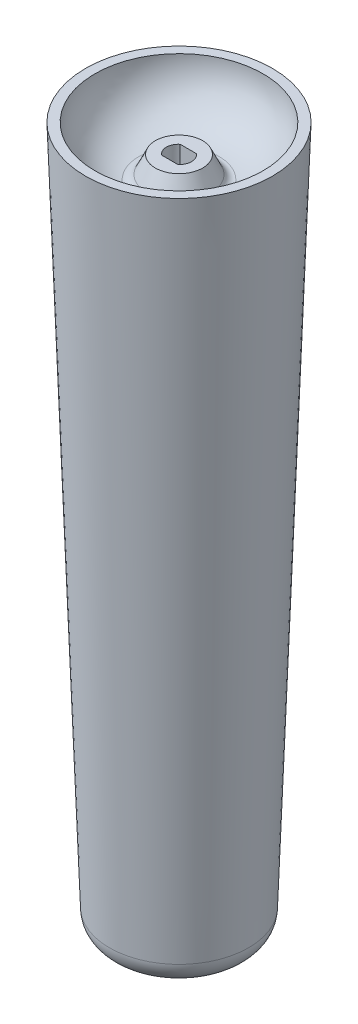
ISO-10303-21;
HEADER;
FILE_DESCRIPTION(('STEP AP214'),'2;1');
FILE_NAME('part.step','',(''),(''),'','','');
FILE_SCHEMA(('AUTOMOTIVE_DESIGN { 1 0 10303 214 1 1 1 1 }'));
ENDSEC;
DATA;
#1=APPLICATION_CONTEXT('core data for automotive mechanical design processes');
#2=APPLICATION_PROTOCOL_DEFINITION('international standard','automotive_design',2000,#1);
#3=PRODUCT_CONTEXT('',#1,'mechanical');
#4=PRODUCT('Part','Part','',(#3));
#5=PRODUCT_RELATED_PRODUCT_CATEGORY('part','',(#4));
#6=PRODUCT_DEFINITION_FORMATION('','',#4);
#7=PRODUCT_DEFINITION_CONTEXT('part definition',#1,'design');
#8=PRODUCT_DEFINITION('design','',#6,#7);
#9=PRODUCT_DEFINITION_SHAPE('','',#8);
#10=(LENGTH_UNIT() NAMED_UNIT(*) SI_UNIT(.MILLI.,.METRE.));
#11=(NAMED_UNIT(*) PLANE_ANGLE_UNIT() SI_UNIT($,.RADIAN.));
#12=(NAMED_UNIT(*) SI_UNIT($,.STERADIAN.) SOLID_ANGLE_UNIT());
#13=UNCERTAINTY_MEASURE_WITH_UNIT(LENGTH_MEASURE(1.E-05),#10,'distance_accuracy_value','');
#14=(GEOMETRIC_REPRESENTATION_CONTEXT(3) GLOBAL_UNCERTAINTY_ASSIGNED_CONTEXT((#13)) GLOBAL_UNIT_ASSIGNED_CONTEXT((#10,
#11,#12)) REPRESENTATION_CONTEXT('',''));
#15=CARTESIAN_POINT('',(0.,0.,0.));
#16=DIRECTION('',(0.,0.,1.));
#17=DIRECTION('',(1.,0.,0.));
#18=AXIS2_PLACEMENT_3D('',#15,#16,#17);
#19=CARTESIAN_POINT('',(0.,-7.18872850840907,0.));
#20=DIRECTION('',(0.,-1.,0.));
#21=DIRECTION('',(0.,0.,-1.));
#22=AXIS2_PLACEMENT_3D('',#19,#20,#21);
#23=CONICAL_SURFACE('',#22,5.35048164496898,0.439460650444469);
#24=CARTESIAN_POINT('',(0.,-6.4087056414976,0.));
#25=DIRECTION('',(0.,-1.,0.));
#26=DIRECTION('',(0.,0.,-1.));
#27=AXIS2_PLACEMENT_3D('',#24,#25,#26);
#28=CIRCLE('',#27,4.9837758856234);
#29=CARTESIAN_POINT('',(0.,-6.4087056414976,-4.9837758856234));
#30=VERTEX_POINT('',#29);
#31=EDGE_CURVE('E140',#30,#30,#28,.F.);
#32=ORIENTED_EDGE('',*,*,#31,.T.);
#33=EDGE_LOOP('',(#32));
#34=FACE_BOUND('',#33,.T.);
#35=CARTESIAN_POINT('',(0.,-3.683,0.));
#36=DIRECTION('',(0.,1.,0.));
#37=DIRECTION('',(0.,0.,1.));
#38=AXIS2_PLACEMENT_3D('',#35,#36,#37);
#39=CIRCLE('',#38,3.70236222530908);
#40=CARTESIAN_POINT('',(0.,-3.683,3.70236222530908));
#41=VERTEX_POINT('',#40);
#42=EDGE_CURVE('E136',#41,#41,#39,.T.);
#43=ORIENTED_EDGE('',*,*,#42,.F.);
#44=EDGE_LOOP('',(#43));
#45=FACE_BOUND('',#44,.T.);
#46=ADVANCED_FACE('F35',(#34,#45),#23,.T.);
#47=CARTESIAN_POINT('',(0.,0.634633404836189,0.));
#48=DIRECTION('',(0.,1.,0.));
#49=DIRECTION('',(0.,0.,1.));
#50=AXIS2_PLACEMENT_3D('',#47,#48,#49);
#51=DEGENERATE_TOROIDAL_SURFACE('',#50,5.32191639984646,7.82341406285296,.T.);
#52=CARTESIAN_POINT('',(0.,-7.12861553218344,0.));
#53=DIRECTION('',(0.,1.,0.));
#54=DIRECTION('',(0.,0.,1.));
#55=AXIS2_PLACEMENT_3D('',#52,#53,#54);
#56=CIRCLE('',#55,6.29030348191064);
#57=CARTESIAN_POINT('',(0.,-7.12861553218344,6.29030348191064));
#58=VERTEX_POINT('',#57);
#59=EDGE_CURVE('E145',#58,#58,#56,.F.);
#60=ORIENTED_EDGE('',*,*,#59,.T.);
#61=EDGE_LOOP('',(#60));
#62=FACE_BOUND('',#61,.T.);
#63=CARTESIAN_POINT('',(0.,0.663198649960341,0.));
#64=DIRECTION('',(0.,1.,0.));
#65=DIRECTION('',(0.,0.,1.));
#66=AXIS2_PLACEMENT_3D('',#63,#64,#65);
#67=CIRCLE('',#66,13.1452783130917);
#68=CARTESIAN_POINT('',(0.,0.663198649960341,13.1452783130917));
#69=VERTEX_POINT('',#68);
#70=EDGE_CURVE('E137',#69,#69,#67,.T.);
#71=ORIENTED_EDGE('',*,*,#70,.T.);
#72=EDGE_LOOP('',(#71));
#73=FACE_BOUND('',#72,.T.);
#74=ADVANCED_FACE('F164',(#62,#73),#51,.F.);
#75=CARTESIAN_POINT('',(13.7077236383959,0.663198649960342,0.));
#76=DIRECTION('',(0.,-1.,0.));
#77=DIRECTION('',(0.,0.,-1.));
#78=AXIS2_PLACEMENT_3D('',#75,#76,#77);
#79=PLANE('',#78);
#80=ORIENTED_EDGE('',*,*,#70,.F.);
#81=EDGE_LOOP('',(#80));
#82=FACE_BOUND('',#81,.T.);
#83=CARTESIAN_POINT('',(0.,0.663198649960339,0.));
#84=DIRECTION('',(0.,-1.,0.));
#85=DIRECTION('',(0.,0.,-1.));
#86=AXIS2_PLACEMENT_3D('',#83,#84,#85);
#87=CIRCLE('',#86,14.605);
#88=CARTESIAN_POINT('',(0.,0.663198649960339,-14.605));
#89=VERTEX_POINT('',#88);
#90=EDGE_CURVE('E133',#89,#89,#87,.T.);
#91=ORIENTED_EDGE('',*,*,#90,.F.);
#92=EDGE_LOOP('',(#91));
#93=FACE_BOUND('',#92,.T.);
#94=ADVANCED_FACE('F170',(#82,#93),#79,.F.);
#95=CARTESIAN_POINT('',(0.,-3.683,0.));
#96=DIRECTION('',(0.,1.,0.));
#97=DIRECTION('',(0.,0.,1.));
#98=AXIS2_PLACEMENT_3D('',#95,#96,#97);
#99=PLANE('',#98);
#100=CARTESIAN_POINT('',(-0.0923636363636069,-3.683,0.));
#101=DIRECTION('',(0.,1.,0.));
#102=DIRECTION('',(0.,0.,1.));
#103=AXIS2_PLACEMENT_3D('',#100,#101,#102);
#104=CIRCLE('',#103,1.87613636363636);
#105=CARTESIAN_POINT('',(-1.26999999999996,-3.683,-1.4605));
#106=VERTEX_POINT('',#105);
#107=CARTESIAN_POINT('',(-1.26999999999996,-3.683,1.46050000000002));
#108=VERTEX_POINT('',#107);
#109=EDGE_CURVE('E54',#106,#108,#104,.T.);
#110=ORIENTED_EDGE('',*,*,#109,.F.);
#111=DIRECTION('',(-1.,0.,0.));
#112=VECTOR('',#111,1.);
#113=CARTESIAN_POINT('',(-1.26999999999996,-3.683,-1.4605));
#114=LINE('',#113,#112);
#115=CARTESIAN_POINT('',(1.27000000000004,-3.683,-1.4605));
#116=VERTEX_POINT('',#115);
#117=EDGE_CURVE('E127',#116,#106,#114,.T.);
#118=ORIENTED_EDGE('',*,*,#117,.F.);
#119=CARTESIAN_POINT('',(0.0923636363636785,-3.683,0.));
#120=DIRECTION('',(0.,1.,0.));
#121=DIRECTION('',(0.,0.,1.));
#122=AXIS2_PLACEMENT_3D('',#119,#120,#121);
#123=CIRCLE('',#122,1.87613636363636);
#124=CARTESIAN_POINT('',(1.27000000000003,-3.683,1.4605));
#125=VERTEX_POINT('',#124);
#126=EDGE_CURVE('E78',#125,#116,#123,.T.);
#127=ORIENTED_EDGE('',*,*,#126,.F.);
#128=DIRECTION('',(1.,0.,0.));
#129=VECTOR('',#128,1.);
#130=CARTESIAN_POINT('',(1.27000000000003,-3.683,1.4605));
#131=LINE('',#130,#129);
#132=EDGE_CURVE('E129',#108,#125,#131,.T.);
#133=ORIENTED_EDGE('',*,*,#132,.F.);
#134=EDGE_LOOP('',(#110,#118,#127,#133));
#135=FACE_BOUND('',#134,.T.);
#136=ORIENTED_EDGE('',*,*,#42,.T.);
#137=EDGE_LOOP('',(#136));
#138=FACE_BOUND('',#137,.T.);
#139=ADVANCED_FACE('F178',(#135,#138),#99,.T.);
#140=CARTESIAN_POINT('',(0.,-5.86838233082078,0.));
#141=DIRECTION('',(0.,1.,0.));
#142=DIRECTION('',(0.,0.,1.));
#143=AXIS2_PLACEMENT_3D('',#140,#141,#142);
#144=TOROIDAL_SURFACE('',#143,6.13310208820439,1.27);
#145=ORIENTED_EDGE('',*,*,#59,.F.);
#146=EDGE_LOOP('',(#145));
#147=FACE_BOUND('',#146,.T.);
#148=ORIENTED_EDGE('',*,*,#31,.F.);
#149=EDGE_LOOP('',(#148));
#150=FACE_BOUND('',#149,.T.);
#151=ADVANCED_FACE('F176',(#147,#150),#144,.F.);
#152=CARTESIAN_POINT('',(0.,-109.347,0.));
#153=DIRECTION('',(0.,-1.,0.));
#154=DIRECTION('',(0.,0.,-1.));
#155=AXIS2_PLACEMENT_3D('',#152,#153,#154);
#156=PLANE('',#155);
#157=CARTESIAN_POINT('',(0.,-109.347,0.));
#158=DIRECTION('',(0.,-1.,0.));
#159=DIRECTION('',(0.,0.,-1.));
#160=AXIS2_PLACEMENT_3D('',#157,#158,#159);
#161=CIRCLE('',#160,7.0840849791884);
#162=CARTESIAN_POINT('',(0.,-109.347,-7.0840849791884));
#163=VERTEX_POINT('',#162);
#164=EDGE_CURVE('E46',#163,#163,#161,.T.);
#165=ORIENTED_EDGE('',*,*,#164,.T.);
#166=EDGE_LOOP('',(#165));
#167=FACE_BOUND('',#166,.T.);
#168=ADVANCED_FACE('F150',(#167),#156,.T.);
#169=CARTESIAN_POINT('',(0.,0.663198649960339,0.));
#170=DIRECTION('',(0.,1.,0.));
#171=DIRECTION('',(0.,0.,-1.));
#172=AXIS2_PLACEMENT_3D('',#169,#170,#171);
#173=CONICAL_SURFACE('',#172,14.605,0.0349065850398867);
#174=CARTESIAN_POINT('',(0.,-105.669967082437,0.));
#175=DIRECTION('',(0.,1.,0.));
#176=DIRECTION('',(0.,0.,1.));
#177=AXIS2_PLACEMENT_3D('',#174,#175,#176);
#178=CIRCLE('',#177,10.8917640301312);
#179=CARTESIAN_POINT('',(0.,-105.669967082437,10.8917640301312));
#180=VERTEX_POINT('',#179);
#181=EDGE_CURVE('E11',#180,#180,#178,.T.);
#182=ORIENTED_EDGE('',*,*,#181,.T.);
#183=EDGE_LOOP('',(#182));
#184=FACE_BOUND('',#183,.T.);
#185=ORIENTED_EDGE('',*,*,#90,.T.);
#186=EDGE_LOOP('',(#185));
#187=FACE_BOUND('',#186,.T.);
#188=ADVANCED_FACE('F154',(#184,#187),#173,.T.);
#189=CARTESIAN_POINT('',(0.,-105.537,0.));
#190=DIRECTION('',(0.,-1.,0.));
#191=DIRECTION('',(0.,0.,-1.));
#192=AXIS2_PLACEMENT_3D('',#189,#190,#191);
#193=TOROIDAL_SURFACE('',#192,7.0840849791884,3.81);
#194=ORIENTED_EDGE('',*,*,#181,.F.);
#195=EDGE_LOOP('',(#194));
#196=FACE_BOUND('',#195,.T.);
#197=ORIENTED_EDGE('',*,*,#164,.F.);
#198=EDGE_LOOP('',(#197));
#199=FACE_BOUND('',#198,.T.);
#200=ADVANCED_FACE('F152',(#196,#199),#193,.T.);
#201=CARTESIAN_POINT('',(-0.0923636363636069,-3.683,0.));
#202=DIRECTION('',(0.,1.,0.));
#203=DIRECTION('',(0.,0.,1.));
#204=AXIS2_PLACEMENT_3D('',#201,#202,#203);
#205=CONICAL_SURFACE('',#204,1.87613636363636,0.0174532925199433);
#206=ORIENTED_EDGE('',*,*,#109,.T.);
#207=CARTESIAN_POINT('',(-1.22371121268793,-11.049,1.33192599173876));
#208=CARTESIAN_POINT('',(-1.23105005130323,-9.9041403436247,1.35190959137449));
#209=CARTESIAN_POINT('',(-1.23832155805528,-8.7592802639708,1.37189319839858));
#210=CARTESIAN_POINT('',(-1.25377204285435,-6.30394706195537,1.41475119886016));
#211=CARTESIAN_POINT('',(-1.26193013187297,-4.99347380827593,1.43762559458983));
#212=CARTESIAN_POINT('',(-1.26999999999995,-3.683,1.46050000000002));
#213=B_SPLINE_CURVE_WITH_KNOTS('',3,(#207,#208,#209,#210,#211,#212),.UNSPECIFIED.,.F.,.F.,(4,2,
4),(0.,3.43517268737795,7.36726748138411),.UNSPECIFIED.);
#214=CARTESIAN_POINT('',(-1.22371121268793,-11.049,1.33192599173876));
#215=VERTEX_POINT('',#214);
#216=EDGE_CURVE('E94',#215,#108,#213,.T.);
#217=ORIENTED_EDGE('',*,*,#216,.F.);
#218=CARTESIAN_POINT('',(-0.0923636363636069,-11.049,0.));
#219=DIRECTION('',(0.,1.,0.));
#220=DIRECTION('',(0.,0.,1.));
#221=AXIS2_PLACEMENT_3D('',#218,#219,#220);
#222=CIRCLE('',#221,1.74756235537511);
#223=CARTESIAN_POINT('',(-1.22371121268794,-11.049,-1.33192599173874));
#224=VERTEX_POINT('',#223);
#225=EDGE_CURVE('E125',#224,#215,#222,.T.);
#226=ORIENTED_EDGE('',*,*,#225,.F.);
#227=CARTESIAN_POINT('',(-1.22371121268794,-11.049,-1.33192599173874));
#228=CARTESIAN_POINT('',(-1.23105005130324,-9.9041403436247,-1.35190959137447));
#229=CARTESIAN_POINT('',(-1.2383215580553,-8.7592802639708,-1.37189319839856));
#230=CARTESIAN_POINT('',(-1.25377204285436,-6.30394706195537,-1.41475119886014));
#231=CARTESIAN_POINT('',(-1.26193013187298,-4.99347380827593,-1.43762559458981));
#232=CARTESIAN_POINT('',(-1.26999999999997,-3.683,-1.4605));
#233=B_SPLINE_CURVE_WITH_KNOTS('',3,(#227,#228,#229,#230,#231,#232),.UNSPECIFIED.,.F.,.F.,(4,2,
4),(0.,3.43517268737795,7.36726748138411),.UNSPECIFIED.);
#234=EDGE_CURVE('E83',#224,#106,#233,.T.);
#235=ORIENTED_EDGE('',*,*,#234,.T.);
#236=EDGE_LOOP('',(#206,#217,#226,#235));
#237=FACE_BOUND('',#236,.T.);
#238=ADVANCED_FACE('F110',(#237),#205,.F.);
#239=CARTESIAN_POINT('',(-1.26999999999996,-3.683,-1.4605));
#240=DIRECTION('',(0.,0.0174524064372835,0.999847695156391));
#241=DIRECTION('',(0.,-0.999847695156391,0.0174524064372835));
#242=AXIS2_PLACEMENT_3D('',#239,#240,#241);
#243=PLANE('',#242);
#244=ORIENTED_EDGE('',*,*,#117,.T.);
#245=ORIENTED_EDGE('',*,*,#234,.F.);
#246=DIRECTION('',(1.,0.,0.));
#247=VECTOR('',#246,1.);
#248=CARTESIAN_POINT('',(-0.0923636363636069,-11.049,-1.33192599173874));
#249=LINE('',#248,#247);
#250=CARTESIAN_POINT('',(1.22371121268802,-11.049,-1.33192599173874));
#251=VERTEX_POINT('',#250);
#252=EDGE_CURVE('E40',#251,#224,#249,.F.);
#253=ORIENTED_EDGE('',*,*,#252,.F.);
#254=CARTESIAN_POINT('',(1.22371121268802,-11.049,-1.33192599173874));
#255=CARTESIAN_POINT('',(1.23105005130332,-9.9041403436247,-1.35190959137447));
#256=CARTESIAN_POINT('',(1.23832155805537,-8.75928026397081,-1.37189319839856));
#257=CARTESIAN_POINT('',(1.25377204285443,-6.30394706195537,-1.41475119886014));
#258=CARTESIAN_POINT('',(1.26193013187306,-4.99347380827593,-1.43762559458981));
#259=CARTESIAN_POINT('',(1.27000000000004,-3.683,-1.4605));
#260=B_SPLINE_CURVE_WITH_KNOTS('',3,(#254,#255,#256,#257,#258,#259),.UNSPECIFIED.,.F.,.F.,(4,2,
4),(0.,3.43517268737794,7.36726748138411),.UNSPECIFIED.);
#261=EDGE_CURVE('E71',#251,#116,#260,.T.);
#262=ORIENTED_EDGE('',*,*,#261,.T.);
#263=EDGE_LOOP('',(#244,#245,#253,#262));
#264=FACE_BOUND('',#263,.T.);
#265=ADVANCED_FACE('F92',(#264),#243,.T.);
#266=CARTESIAN_POINT('',(0.0923636363636785,-3.683,0.));
#267=DIRECTION('',(0.,1.,0.));
#268=DIRECTION('',(0.,0.,1.));
#269=AXIS2_PLACEMENT_3D('',#266,#267,#268);
#270=CONICAL_SURFACE('',#269,1.87613636363636,0.0174532925199433);
#271=ORIENTED_EDGE('',*,*,#126,.T.);
#272=ORIENTED_EDGE('',*,*,#261,.F.);
#273=CARTESIAN_POINT('',(0.0923636363636785,-11.049,0.));
#274=DIRECTION('',(0.,1.,0.));
#275=DIRECTION('',(0.,0.,1.));
#276=AXIS2_PLACEMENT_3D('',#273,#274,#275);
#277=CIRCLE('',#276,1.74756235537511);
#278=CARTESIAN_POINT('',(1.22371121268801,-11.049,1.33192599173875));
#279=VERTEX_POINT('',#278);
#280=EDGE_CURVE('E74',#279,#251,#277,.T.);
#281=ORIENTED_EDGE('',*,*,#280,.F.);
#282=CARTESIAN_POINT('',(1.22371121268801,-11.049,1.33192599173875));
#283=CARTESIAN_POINT('',(1.23105005130331,-9.9041403436247,1.35190959137448));
#284=CARTESIAN_POINT('',(1.23832155805536,-8.75928026397081,1.37189319839856));
#285=CARTESIAN_POINT('',(1.25377204285443,-6.30394706195537,1.41475119886015));
#286=CARTESIAN_POINT('',(1.26193013187305,-4.99347380827593,1.43762559458982));
#287=CARTESIAN_POINT('',(1.27000000000003,-3.683,1.4605));
#288=B_SPLINE_CURVE_WITH_KNOTS('',3,(#282,#283,#284,#285,#286,#287),.UNSPECIFIED.,.F.,.F.,(4,2,
4),(0.,3.43517268737794,7.36726748138411),.UNSPECIFIED.);
#289=EDGE_CURVE('E84',#279,#125,#288,.T.);
#290=ORIENTED_EDGE('',*,*,#289,.T.);
#291=EDGE_LOOP('',(#271,#272,#281,#290));
#292=FACE_BOUND('',#291,.T.);
#293=ADVANCED_FACE('F37',(#292),#270,.F.);
#294=CARTESIAN_POINT('',(1.27000000000003,-3.683,1.4605));
#295=DIRECTION('',(0.,0.0174524064372835,-0.999847695156391));
#296=DIRECTION('',(0.,0.999847695156391,0.0174524064372835));
#297=AXIS2_PLACEMENT_3D('',#294,#295,#296);
#298=PLANE('',#297);
#299=ORIENTED_EDGE('',*,*,#132,.T.);
#300=ORIENTED_EDGE('',*,*,#289,.F.);
#301=DIRECTION('',(-1.,0.,0.));
#302=VECTOR('',#301,1.);
#303=CARTESIAN_POINT('',(-0.0923636363635989,-11.049,1.33192599173876));
#304=LINE('',#303,#302);
#305=EDGE_CURVE('E91',#215,#279,#304,.F.);
#306=ORIENTED_EDGE('',*,*,#305,.F.);
#307=ORIENTED_EDGE('',*,*,#216,.T.);
#308=EDGE_LOOP('',(#299,#300,#306,#307));
#309=FACE_BOUND('',#308,.T.);
#310=ADVANCED_FACE('F113',(#309),#298,.T.);
#311=CARTESIAN_POINT('',(-0.0923636363636069,-11.049,0.));
#312=DIRECTION('',(0.,1.,0.));
#313=DIRECTION('',(0.,0.,1.));
#314=AXIS2_PLACEMENT_3D('',#311,#312,#313);
#315=PLANE('',#314);
#316=ORIENTED_EDGE('',*,*,#225,.T.);
#317=ORIENTED_EDGE('',*,*,#305,.T.);
#318=ORIENTED_EDGE('',*,*,#280,.T.);
#319=ORIENTED_EDGE('',*,*,#252,.T.);
#320=EDGE_LOOP('',(#316,#317,#318,#319));
#321=FACE_BOUND('',#320,.T.);
#322=ADVANCED_FACE('F89',(#321),#315,.T.);
#323=CLOSED_SHELL('',(#46,#74,#94,#139,#151,#168,#188,#200,#238,#265,#293,#310,#322));
#324=MANIFOLD_SOLID_BREP('B2',#323);
#325=ADVANCED_BREP_SHAPE_REPRESENTATION('',(#18,#324),#14);
#326=SHAPE_DEFINITION_REPRESENTATION(#9,#325);
ENDSEC;
END-ISO-10303-21;
